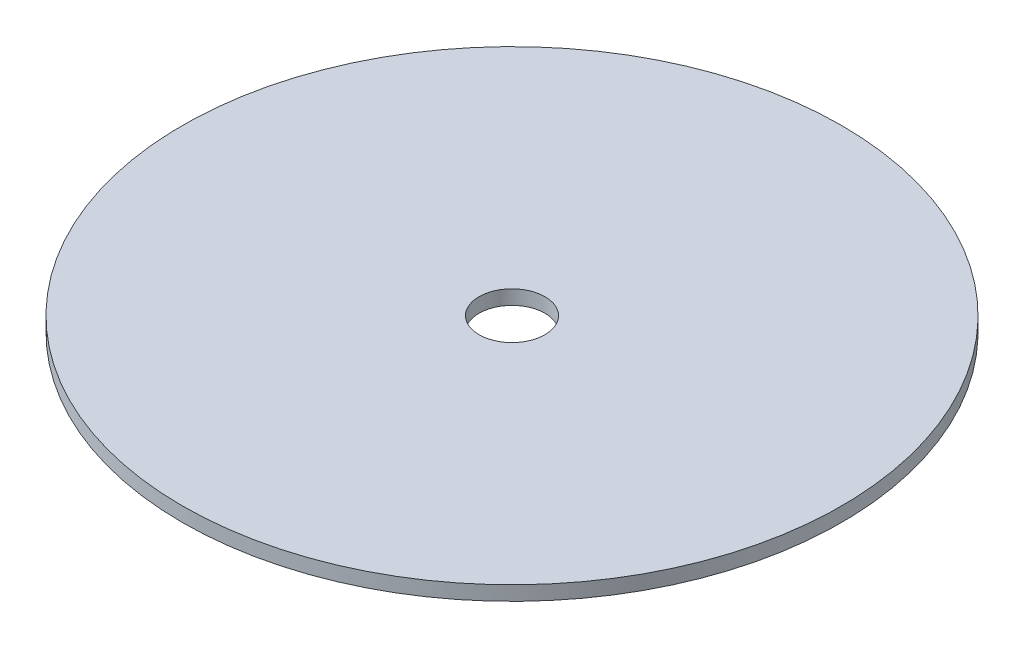
ISO-10303-21;
HEADER;
FILE_DESCRIPTION(('STEP AP214'),'2;1');
FILE_NAME('part.step','',(''),(''),'','','');
FILE_SCHEMA(('AUTOMOTIVE_DESIGN { 1 0 10303 214 1 1 1 1 }'));
ENDSEC;
DATA;
#1=APPLICATION_CONTEXT('core data for automotive mechanical design processes');
#2=APPLICATION_PROTOCOL_DEFINITION('international standard','automotive_design',2000,#1);
#3=PRODUCT_CONTEXT('',#1,'mechanical');
#4=PRODUCT('Part','Part','',(#3));
#5=PRODUCT_RELATED_PRODUCT_CATEGORY('part','',(#4));
#6=PRODUCT_DEFINITION_FORMATION('','',#4);
#7=PRODUCT_DEFINITION_CONTEXT('part definition',#1,'design');
#8=PRODUCT_DEFINITION('design','',#6,#7);
#9=PRODUCT_DEFINITION_SHAPE('','',#8);
#10=(LENGTH_UNIT() NAMED_UNIT(*) SI_UNIT(.MILLI.,.METRE.));
#11=(NAMED_UNIT(*) PLANE_ANGLE_UNIT() SI_UNIT($,.RADIAN.));
#12=(NAMED_UNIT(*) SI_UNIT($,.STERADIAN.) SOLID_ANGLE_UNIT());
#13=UNCERTAINTY_MEASURE_WITH_UNIT(LENGTH_MEASURE(1.E-05),#10,'distance_accuracy_value','');
#14=(GEOMETRIC_REPRESENTATION_CONTEXT(3) GLOBAL_UNCERTAINTY_ASSIGNED_CONTEXT((#13)) GLOBAL_UNIT_ASSIGNED_CONTEXT((#10,
#11,#12)) REPRESENTATION_CONTEXT('',''));
#15=CARTESIAN_POINT('',(0.,0.,0.));
#16=DIRECTION('',(0.,0.,1.));
#17=DIRECTION('',(1.,0.,0.));
#18=AXIS2_PLACEMENT_3D('',#15,#16,#17);
#19=CARTESIAN_POINT('',(0.,4.16,0.));
#20=DIRECTION('',(0.,1.,0.));
#21=DIRECTION('',(0.,0.,1.));
#22=AXIS2_PLACEMENT_3D('',#19,#20,#21);
#23=PLANE('',#22);
#24=CARTESIAN_POINT('',(0.,4.16,0.));
#25=DIRECTION('',(0.,1.,0.));
#26=DIRECTION('',(0.,0.,1.));
#27=AXIS2_PLACEMENT_3D('',#24,#25,#26);
#28=CIRCLE('',#27,9.525);
#29=CARTESIAN_POINT('',(0.,4.16,9.525));
#30=VERTEX_POINT('',#29);
#31=EDGE_CURVE('E10',#30,#30,#28,.T.);
#32=ORIENTED_EDGE('',*,*,#31,.F.);
#33=EDGE_LOOP('',(#32));
#34=FACE_BOUND('',#33,.T.);
#35=CARTESIAN_POINT('',(0.,4.16,0.));
#36=DIRECTION('',(0.,1.,0.));
#37=DIRECTION('',(0.,0.,1.));
#38=AXIS2_PLACEMENT_3D('',#35,#36,#37);
#39=CIRCLE('',#38,95.25);
#40=CARTESIAN_POINT('',(0.,4.16,95.25));
#41=VERTEX_POINT('',#40);
#42=EDGE_CURVE('E46',#41,#41,#39,.T.);
#43=ORIENTED_EDGE('',*,*,#42,.T.);
#44=EDGE_LOOP('',(#43));
#45=FACE_BOUND('',#44,.T.);
#46=ADVANCED_FACE('F33',(#34,#45),#23,.T.);
#47=CARTESIAN_POINT('',(0.,0.,0.));
#48=DIRECTION('',(0.,1.,0.));
#49=DIRECTION('',(0.,0.,1.));
#50=AXIS2_PLACEMENT_3D('',#47,#48,#49);
#51=PLANE('',#50);
#52=CARTESIAN_POINT('',(0.,0.,0.));
#53=DIRECTION('',(0.,1.,0.));
#54=DIRECTION('',(0.,0.,1.));
#55=AXIS2_PLACEMENT_3D('',#52,#53,#54);
#56=CIRCLE('',#55,9.525);
#57=CARTESIAN_POINT('',(0.,0.,9.525));
#58=VERTEX_POINT('',#57);
#59=EDGE_CURVE('E37',#58,#58,#56,.T.);
#60=ORIENTED_EDGE('',*,*,#59,.T.);
#61=EDGE_LOOP('',(#60));
#62=FACE_BOUND('',#61,.T.);
#63=CARTESIAN_POINT('',(0.,0.,0.));
#64=DIRECTION('',(0.,1.,0.));
#65=DIRECTION('',(0.,0.,1.));
#66=AXIS2_PLACEMENT_3D('',#63,#64,#65);
#67=CIRCLE('',#66,95.25);
#68=CARTESIAN_POINT('',(0.,0.,95.25));
#69=VERTEX_POINT('',#68);
#70=EDGE_CURVE('E44',#69,#69,#67,.T.);
#71=ORIENTED_EDGE('',*,*,#70,.F.);
#72=EDGE_LOOP('',(#71));
#73=FACE_BOUND('',#72,.T.);
#74=ADVANCED_FACE('F35',(#62,#73),#51,.F.);
#75=CARTESIAN_POINT('',(0.,4.16,0.));
#76=DIRECTION('',(0.,-1.,0.));
#77=DIRECTION('',(0.,0.,-1.));
#78=AXIS2_PLACEMENT_3D('',#75,#76,#77);
#79=CYLINDRICAL_SURFACE('',#78,9.525);
#80=ORIENTED_EDGE('',*,*,#31,.T.);
#81=EDGE_LOOP('',(#80));
#82=FACE_BOUND('',#81,.T.);
#83=ORIENTED_EDGE('',*,*,#59,.F.);
#84=EDGE_LOOP('',(#83));
#85=FACE_BOUND('',#84,.T.);
#86=ADVANCED_FACE('F56',(#82,#85),#79,.F.);
#87=CARTESIAN_POINT('',(0.,0.,0.));
#88=DIRECTION('',(0.,1.,0.));
#89=DIRECTION('',(0.,0.,1.));
#90=AXIS2_PLACEMENT_3D('',#87,#88,#89);
#91=CYLINDRICAL_SURFACE('',#90,95.25);
#92=ORIENTED_EDGE('',*,*,#70,.T.);
#93=EDGE_LOOP('',(#92));
#94=FACE_BOUND('',#93,.T.);
#95=ORIENTED_EDGE('',*,*,#42,.F.);
#96=EDGE_LOOP('',(#95));
#97=FACE_BOUND('',#96,.T.);
#98=ADVANCED_FACE('F52',(#94,#97),#91,.T.);
#99=CLOSED_SHELL('',(#46,#74,#86,#98));
#100=MANIFOLD_SOLID_BREP('B2',#99);
#101=ADVANCED_BREP_SHAPE_REPRESENTATION('',(#18,#100),#14);
#102=SHAPE_DEFINITION_REPRESENTATION(#9,#101);
ENDSEC;
END-ISO-10303-21;
